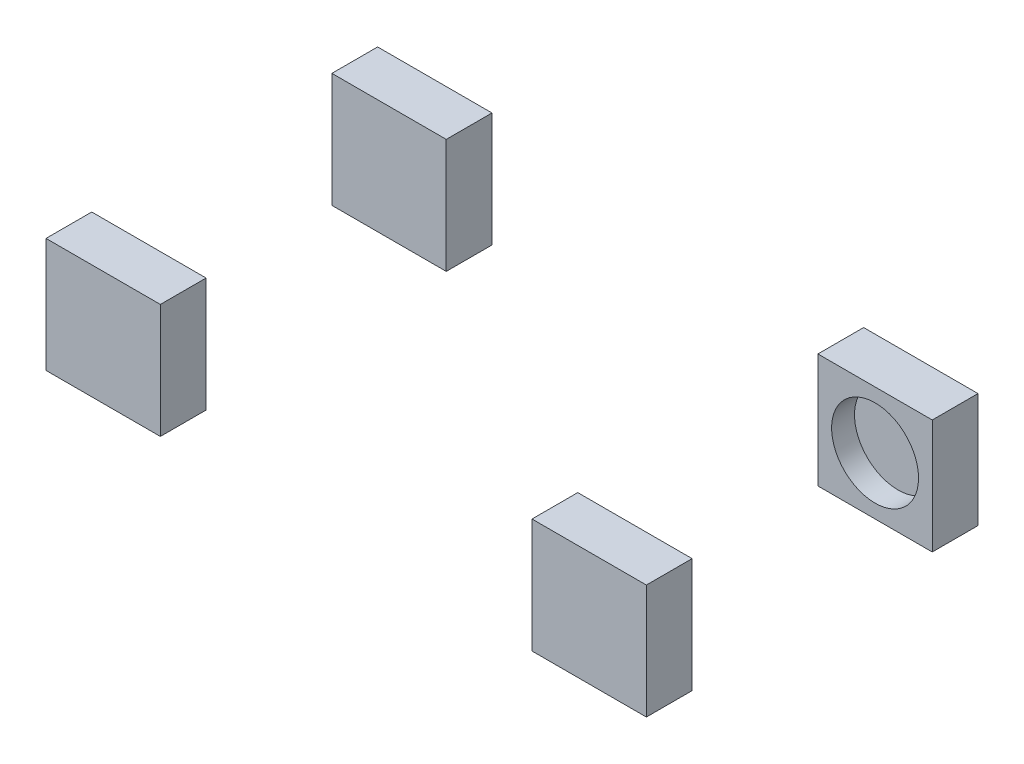
ISO-10303-21;
HEADER;
FILE_DESCRIPTION(('STEP AP214'),'2;1');
FILE_NAME('part.step','',(''),(''),'','','');
FILE_SCHEMA(('AUTOMOTIVE_DESIGN { 1 0 10303 214 1 1 1 1 }'));
ENDSEC;
DATA;
#1=APPLICATION_CONTEXT('core data for automotive mechanical design processes');
#2=APPLICATION_PROTOCOL_DEFINITION('international standard','automotive_design',2000,#1);
#3=PRODUCT_CONTEXT('',#1,'mechanical');
#4=PRODUCT('Part','Part','',(#3));
#5=PRODUCT_RELATED_PRODUCT_CATEGORY('part','',(#4));
#6=PRODUCT_DEFINITION_FORMATION('','',#4);
#7=PRODUCT_DEFINITION_CONTEXT('part definition',#1,'design');
#8=PRODUCT_DEFINITION('design','',#6,#7);
#9=PRODUCT_DEFINITION_SHAPE('','',#8);
#10=(LENGTH_UNIT() NAMED_UNIT(*) SI_UNIT(.MILLI.,.METRE.));
#11=(NAMED_UNIT(*) PLANE_ANGLE_UNIT() SI_UNIT($,.RADIAN.));
#12=(NAMED_UNIT(*) SI_UNIT($,.STERADIAN.) SOLID_ANGLE_UNIT());
#13=UNCERTAINTY_MEASURE_WITH_UNIT(LENGTH_MEASURE(1.E-05),#10,'distance_accuracy_value','');
#14=(GEOMETRIC_REPRESENTATION_CONTEXT(3) GLOBAL_UNCERTAINTY_ASSIGNED_CONTEXT((#13)) GLOBAL_UNIT_ASSIGNED_CONTEXT((#10,
#11,#12)) REPRESENTATION_CONTEXT('',''));
#15=CARTESIAN_POINT('',(0.,0.,0.));
#16=DIRECTION('',(0.,0.,1.));
#17=DIRECTION('',(1.,0.,0.));
#18=AXIS2_PLACEMENT_3D('',#15,#16,#17);
#19=CARTESIAN_POINT('',(0.,50.,105.));
#20=DIRECTION('',(0.,0.,-1.));
#21=DIRECTION('',(-1.,0.,0.));
#22=AXIS2_PLACEMENT_3D('',#19,#20,#21);
#23=PLANE('',#22);
#24=CARTESIAN_POINT('',(212.5,0.,105.));
#25=DIRECTION('',(0.,0.,-1.));
#26=DIRECTION('',(-1.,0.,0.));
#27=AXIS2_PLACEMENT_3D('',#24,#25,#26);
#28=CIRCLE('',#27,38.);
#29=CARTESIAN_POINT('',(174.5,0.,105.));
#30=VERTEX_POINT('',#29);
#31=EDGE_CURVE('E158',#30,#30,#28,.T.);
#32=ORIENTED_EDGE('',*,*,#31,.F.);
#33=EDGE_LOOP('',(#32));
#34=FACE_BOUND('',#33,.T.);
#35=DIRECTION('',(0.,-1.,0.));
#36=VECTOR('',#35,1.);
#37=CARTESIAN_POINT('',(262.5,50.,105.));
#38=LINE('',#37,#36);
#39=CARTESIAN_POINT('',(262.5,50.,105.));
#40=VERTEX_POINT('',#39);
#41=CARTESIAN_POINT('',(262.5,-50.,105.));
#42=VERTEX_POINT('',#41);
#43=EDGE_CURVE('E131',#40,#42,#38,.T.);
#44=ORIENTED_EDGE('',*,*,#43,.T.);
#45=DIRECTION('',(1.,0.,0.));
#46=VECTOR('',#45,1.);
#47=CARTESIAN_POINT('',(162.5,-50.,105.));
#48=LINE('',#47,#46);
#49=CARTESIAN_POINT('',(162.5,-50.,105.));
#50=VERTEX_POINT('',#49);
#51=EDGE_CURVE('E97',#50,#42,#48,.T.);
#52=ORIENTED_EDGE('',*,*,#51,.F.);
#53=DIRECTION('',(0.,-1.,0.));
#54=VECTOR('',#53,1.);
#55=CARTESIAN_POINT('',(162.5,50.,105.));
#56=LINE('',#55,#54);
#57=CARTESIAN_POINT('',(162.5,50.,105.));
#58=VERTEX_POINT('',#57);
#59=EDGE_CURVE('E105',#58,#50,#56,.T.);
#60=ORIENTED_EDGE('',*,*,#59,.F.);
#61=DIRECTION('',(1.,0.,0.));
#62=VECTOR('',#61,1.);
#63=CARTESIAN_POINT('',(162.5,50.,105.));
#64=LINE('',#63,#62);
#65=EDGE_CURVE('E128',#58,#40,#64,.T.);
#66=ORIENTED_EDGE('',*,*,#65,.T.);
#67=EDGE_LOOP('',(#44,#52,#60,#66));
#68=FACE_BOUND('',#67,.T.);
#69=ADVANCED_FACE('F87',(#34,#68),#23,.T.);
#70=CARTESIAN_POINT('',(0.,-50.,0.));
#71=DIRECTION('',(0.,1.,0.));
#72=DIRECTION('',(0.,0.,1.));
#73=AXIS2_PLACEMENT_3D('',#70,#71,#72);
#74=PLANE('',#73);
#75=DIRECTION('',(0.,0.,1.));
#76=VECTOR('',#75,1.);
#77=CARTESIAN_POINT('',(262.5,-50.,0.));
#78=LINE('',#77,#76);
#79=CARTESIAN_POINT('',(262.5,-50.,145.));
#80=VERTEX_POINT('',#79);
#81=EDGE_CURVE('E139',#42,#80,#78,.T.);
#82=ORIENTED_EDGE('',*,*,#81,.T.);
#83=DIRECTION('',(1.,0.,0.));
#84=VECTOR('',#83,1.);
#85=CARTESIAN_POINT('',(0.,-50.,145.));
#86=LINE('',#85,#84);
#87=CARTESIAN_POINT('',(162.5,-50.,145.));
#88=VERTEX_POINT('',#87);
#89=EDGE_CURVE('E146',#88,#80,#86,.T.);
#90=ORIENTED_EDGE('',*,*,#89,.F.);
#91=DIRECTION('',(0.,0.,1.));
#92=VECTOR('',#91,1.);
#93=CARTESIAN_POINT('',(162.5,-50.,105.));
#94=LINE('',#93,#92);
#95=EDGE_CURVE('E13',#50,#88,#94,.T.);
#96=ORIENTED_EDGE('',*,*,#95,.F.);
#97=ORIENTED_EDGE('',*,*,#51,.T.);
#98=EDGE_LOOP('',(#82,#90,#96,#97));
#99=FACE_BOUND('',#98,.T.);
#100=ADVANCED_FACE('F173',(#99),#74,.F.);
#101=CARTESIAN_POINT('',(162.5,50.,-1.12757025938492E-13));
#102=DIRECTION('',(1.,0.,0.));
#103=DIRECTION('',(0.,0.,-1.));
#104=AXIS2_PLACEMENT_3D('',#101,#102,#103);
#105=PLANE('',#104);
#106=ORIENTED_EDGE('',*,*,#95,.T.);
#107=DIRECTION('',(0.,-1.,0.));
#108=VECTOR('',#107,1.);
#109=CARTESIAN_POINT('',(162.5,50.,145.));
#110=LINE('',#109,#108);
#111=CARTESIAN_POINT('',(162.5,50.,145.));
#112=VERTEX_POINT('',#111);
#113=EDGE_CURVE('E140',#112,#88,#110,.T.);
#114=ORIENTED_EDGE('',*,*,#113,.F.);
#115=DIRECTION('',(0.,0.,1.));
#116=VECTOR('',#115,1.);
#117=CARTESIAN_POINT('',(162.5,50.,105.));
#118=LINE('',#117,#116);
#119=EDGE_CURVE('E123',#58,#112,#118,.T.);
#120=ORIENTED_EDGE('',*,*,#119,.F.);
#121=ORIENTED_EDGE('',*,*,#59,.T.);
#122=EDGE_LOOP('',(#106,#114,#120,#121));
#123=FACE_BOUND('',#122,.T.);
#124=ADVANCED_FACE('F175',(#123),#105,.F.);
#125=CARTESIAN_POINT('',(0.,50.,145.));
#126=DIRECTION('',(0.,0.,-1.));
#127=DIRECTION('',(-1.,0.,0.));
#128=AXIS2_PLACEMENT_3D('',#125,#126,#127);
#129=PLANE('',#128);
#130=ORIENTED_EDGE('',*,*,#89,.T.);
#131=DIRECTION('',(0.,-1.,0.));
#132=VECTOR('',#131,1.);
#133=CARTESIAN_POINT('',(262.5,50.,145.));
#134=LINE('',#133,#132);
#135=CARTESIAN_POINT('',(262.5,50.,145.));
#136=VERTEX_POINT('',#135);
#137=EDGE_CURVE('E149',#136,#80,#134,.T.);
#138=ORIENTED_EDGE('',*,*,#137,.F.);
#139=DIRECTION('',(1.,0.,0.));
#140=VECTOR('',#139,1.);
#141=CARTESIAN_POINT('',(0.,50.,145.));
#142=LINE('',#141,#140);
#143=EDGE_CURVE('E144',#112,#136,#142,.T.);
#144=ORIENTED_EDGE('',*,*,#143,.F.);
#145=ORIENTED_EDGE('',*,*,#113,.T.);
#146=EDGE_LOOP('',(#130,#138,#144,#145));
#147=FACE_BOUND('',#146,.T.);
#148=ADVANCED_FACE('F184',(#147),#129,.F.);
#149=CARTESIAN_POINT('',(262.5,50.,0.));
#150=DIRECTION('',(1.,0.,0.));
#151=DIRECTION('',(0.,0.,-1.));
#152=AXIS2_PLACEMENT_3D('',#149,#150,#151);
#153=PLANE('',#152);
#154=ORIENTED_EDGE('',*,*,#81,.F.);
#155=ORIENTED_EDGE('',*,*,#43,.F.);
#156=DIRECTION('',(0.,0.,1.));
#157=VECTOR('',#156,1.);
#158=CARTESIAN_POINT('',(262.5,50.,0.));
#159=LINE('',#158,#157);
#160=EDGE_CURVE('E91',#40,#136,#159,.T.);
#161=ORIENTED_EDGE('',*,*,#160,.T.);
#162=ORIENTED_EDGE('',*,*,#137,.T.);
#163=EDGE_LOOP('',(#154,#155,#161,#162));
#164=FACE_BOUND('',#163,.T.);
#165=ADVANCED_FACE('F137',(#164),#153,.T.);
#166=CARTESIAN_POINT('',(0.,50.,0.));
#167=DIRECTION('',(0.,1.,0.));
#168=DIRECTION('',(0.,0.,1.));
#169=AXIS2_PLACEMENT_3D('',#166,#167,#168);
#170=PLANE('',#169);
#171=ORIENTED_EDGE('',*,*,#160,.F.);
#172=ORIENTED_EDGE('',*,*,#65,.F.);
#173=ORIENTED_EDGE('',*,*,#119,.T.);
#174=ORIENTED_EDGE('',*,*,#143,.T.);
#175=EDGE_LOOP('',(#171,#172,#173,#174));
#176=FACE_BOUND('',#175,.T.);
#177=ADVANCED_FACE('F89',(#176),#170,.T.);
#178=CARTESIAN_POINT('',(212.5,0.,125.));
#179=DIRECTION('',(0.,0.,-1.));
#180=DIRECTION('',(-1.,0.,0.));
#181=AXIS2_PLACEMENT_3D('',#178,#179,#180);
#182=CYLINDRICAL_SURFACE('',#181,38.);
#183=CARTESIAN_POINT('',(212.5,0.,125.));
#184=DIRECTION('',(0.,0.,-1.));
#185=DIRECTION('',(-1.,0.,0.));
#186=AXIS2_PLACEMENT_3D('',#183,#184,#185);
#187=CIRCLE('',#186,38.);
#188=CARTESIAN_POINT('',(174.5,0.,125.));
#189=VERTEX_POINT('',#188);
#190=EDGE_CURVE('E141',#189,#189,#187,.T.);
#191=ORIENTED_EDGE('',*,*,#190,.F.);
#192=EDGE_LOOP('',(#191));
#193=FACE_BOUND('',#192,.T.);
#194=ORIENTED_EDGE('',*,*,#31,.T.);
#195=EDGE_LOOP('',(#194));
#196=FACE_BOUND('',#195,.T.);
#197=ADVANCED_FACE('F166',(#193,#196),#182,.F.);
#198=CARTESIAN_POINT('',(212.5,0.,125.));
#199=DIRECTION('',(0.,0.,-1.));
#200=DIRECTION('',(-1.,0.,0.));
#201=AXIS2_PLACEMENT_3D('',#198,#199,#200);
#202=PLANE('',#201);
#203=ORIENTED_EDGE('',*,*,#190,.T.);
#204=EDGE_LOOP('',(#203));
#205=FACE_BOUND('',#204,.T.);
#206=ADVANCED_FACE('F164',(#205),#202,.T.);
#207=CLOSED_SHELL('',(#69,#100,#124,#148,#165,#177,#197,#206));
#208=MANIFOLD_SOLID_BREP('B2',#207);
#209=CARTESIAN_POINT('',(-162.5,50.,-1.12757025938492E-13));
#210=DIRECTION('',(1.,0.,0.));
#211=DIRECTION('',(0.,0.,-1.));
#212=AXIS2_PLACEMENT_3D('',#209,#210,#211);
#213=PLANE('',#212);
#214=DIRECTION('',(0.,0.,1.));
#215=VECTOR('',#214,1.);
#216=CARTESIAN_POINT('',(-162.5,-50.,-1.12757025938492E-13));
#217=LINE('',#216,#215);
#218=CARTESIAN_POINT('',(-162.5,-50.,105.));
#219=VERTEX_POINT('',#218);
#220=CARTESIAN_POINT('',(-162.5,-50.,145.));
#221=VERTEX_POINT('',#220);
#222=EDGE_CURVE('E85',#219,#221,#217,.T.);
#223=ORIENTED_EDGE('',*,*,#222,.F.);
#224=DIRECTION('',(0.,-1.,0.));
#225=VECTOR('',#224,1.);
#226=CARTESIAN_POINT('',(-162.5,50.,105.));
#227=LINE('',#226,#225);
#228=CARTESIAN_POINT('',(-162.5,50.,105.));
#229=VERTEX_POINT('',#228);
#230=EDGE_CURVE('E281',#229,#219,#227,.T.);
#231=ORIENTED_EDGE('',*,*,#230,.F.);
#232=DIRECTION('',(0.,0.,1.));
#233=VECTOR('',#232,1.);
#234=CARTESIAN_POINT('',(-162.5,50.,-1.12757025938492E-13));
#235=LINE('',#234,#233);
#236=CARTESIAN_POINT('',(-162.5,50.,145.));
#237=VERTEX_POINT('',#236);
#238=EDGE_CURVE('E266',#229,#237,#235,.T.);
#239=ORIENTED_EDGE('',*,*,#238,.T.);
#240=DIRECTION('',(0.,-1.,0.));
#241=VECTOR('',#240,1.);
#242=CARTESIAN_POINT('',(-162.5,50.,145.));
#243=LINE('',#242,#241);
#244=EDGE_CURVE('E304',#237,#221,#243,.T.);
#245=ORIENTED_EDGE('',*,*,#244,.T.);
#246=EDGE_LOOP('',(#223,#231,#239,#245));
#247=FACE_BOUND('',#246,.T.);
#248=ADVANCED_FACE('F262',(#247),#213,.T.);
#249=CARTESIAN_POINT('',(0.,50.,105.));
#250=DIRECTION('',(0.,0.,1.));
#251=DIRECTION('',(1.,0.,0.));
#252=AXIS2_PLACEMENT_3D('',#249,#250,#251);
#253=PLANE('',#252);
#254=DIRECTION('',(-1.,0.,0.));
#255=VECTOR('',#254,1.);
#256=CARTESIAN_POINT('',(0.,-50.,105.));
#257=LINE('',#256,#255);
#258=CARTESIAN_POINT('',(-262.5,-50.,105.));
#259=VERTEX_POINT('',#258);
#260=EDGE_CURVE('E272',#219,#259,#257,.T.);
#261=ORIENTED_EDGE('',*,*,#260,.T.);
#262=DIRECTION('',(0.,-1.,0.));
#263=VECTOR('',#262,1.);
#264=CARTESIAN_POINT('',(-262.5,50.,105.));
#265=LINE('',#264,#263);
#266=CARTESIAN_POINT('',(-262.5,50.,105.));
#267=VERTEX_POINT('',#266);
#268=EDGE_CURVE('E319',#267,#259,#265,.T.);
#269=ORIENTED_EDGE('',*,*,#268,.F.);
#270=DIRECTION('',(-1.,0.,0.));
#271=VECTOR('',#270,1.);
#272=CARTESIAN_POINT('',(0.,50.,105.));
#273=LINE('',#272,#271);
#274=EDGE_CURVE('E296',#229,#267,#273,.T.);
#275=ORIENTED_EDGE('',*,*,#274,.F.);
#276=ORIENTED_EDGE('',*,*,#230,.T.);
#277=EDGE_LOOP('',(#261,#269,#275,#276));
#278=FACE_BOUND('',#277,.T.);
#279=ADVANCED_FACE('F335',(#278),#253,.F.);
#280=CARTESIAN_POINT('',(-262.5,50.,0.));
#281=DIRECTION('',(1.,0.,0.));
#282=DIRECTION('',(0.,0.,-1.));
#283=AXIS2_PLACEMENT_3D('',#280,#281,#282);
#284=PLANE('',#283);
#285=DIRECTION('',(0.,0.,1.));
#286=VECTOR('',#285,1.);
#287=CARTESIAN_POINT('',(-262.5,-50.,0.));
#288=LINE('',#287,#286);
#289=CARTESIAN_POINT('',(-262.5,-50.,145.));
#290=VERTEX_POINT('',#289);
#291=EDGE_CURVE('E323',#259,#290,#288,.T.);
#292=ORIENTED_EDGE('',*,*,#291,.T.);
#293=DIRECTION('',(0.,-1.,0.));
#294=VECTOR('',#293,1.);
#295=CARTESIAN_POINT('',(-262.5,50.,145.));
#296=LINE('',#295,#294);
#297=CARTESIAN_POINT('',(-262.5,50.,145.));
#298=VERTEX_POINT('',#297);
#299=EDGE_CURVE('E310',#298,#290,#296,.T.);
#300=ORIENTED_EDGE('',*,*,#299,.F.);
#301=DIRECTION('',(0.,0.,1.));
#302=VECTOR('',#301,1.);
#303=CARTESIAN_POINT('',(-262.5,50.,0.));
#304=LINE('',#303,#302);
#305=EDGE_CURVE('E333',#267,#298,#304,.T.);
#306=ORIENTED_EDGE('',*,*,#305,.F.);
#307=ORIENTED_EDGE('',*,*,#268,.T.);
#308=EDGE_LOOP('',(#292,#300,#306,#307));
#309=FACE_BOUND('',#308,.T.);
#310=ADVANCED_FACE('F324',(#309),#284,.F.);
#311=CARTESIAN_POINT('',(0.,50.,145.));
#312=DIRECTION('',(0.,0.,1.));
#313=DIRECTION('',(1.,0.,0.));
#314=AXIS2_PLACEMENT_3D('',#311,#312,#313);
#315=PLANE('',#314);
#316=DIRECTION('',(-1.,0.,0.));
#317=VECTOR('',#316,1.);
#318=CARTESIAN_POINT('',(0.,-50.,145.));
#319=LINE('',#318,#317);
#320=EDGE_CURVE('E314',#221,#290,#319,.T.);
#321=ORIENTED_EDGE('',*,*,#320,.F.);
#322=ORIENTED_EDGE('',*,*,#244,.F.);
#323=DIRECTION('',(-1.,0.,0.));
#324=VECTOR('',#323,1.);
#325=CARTESIAN_POINT('',(0.,50.,145.));
#326=LINE('',#325,#324);
#327=EDGE_CURVE('E316',#237,#298,#326,.T.);
#328=ORIENTED_EDGE('',*,*,#327,.T.);
#329=ORIENTED_EDGE('',*,*,#299,.T.);
#330=EDGE_LOOP('',(#321,#322,#328,#329));
#331=FACE_BOUND('',#330,.T.);
#332=ADVANCED_FACE('F312',(#331),#315,.T.);
#333=CARTESIAN_POINT('',(0.,50.,0.));
#334=DIRECTION('',(0.,1.,0.));
#335=DIRECTION('',(0.,0.,1.));
#336=AXIS2_PLACEMENT_3D('',#333,#334,#335);
#337=PLANE('',#336);
#338=ORIENTED_EDGE('',*,*,#238,.F.);
#339=ORIENTED_EDGE('',*,*,#274,.T.);
#340=ORIENTED_EDGE('',*,*,#305,.T.);
#341=ORIENTED_EDGE('',*,*,#327,.F.);
#342=EDGE_LOOP('',(#338,#339,#340,#341));
#343=FACE_BOUND('',#342,.T.);
#344=ADVANCED_FACE('F264',(#343),#337,.T.);
#345=CARTESIAN_POINT('',(0.,-50.,0.));
#346=DIRECTION('',(0.,1.,0.));
#347=DIRECTION('',(0.,0.,1.));
#348=AXIS2_PLACEMENT_3D('',#345,#346,#347);
#349=PLANE('',#348);
#350=ORIENTED_EDGE('',*,*,#222,.T.);
#351=ORIENTED_EDGE('',*,*,#320,.T.);
#352=ORIENTED_EDGE('',*,*,#291,.F.);
#353=ORIENTED_EDGE('',*,*,#260,.F.);
#354=EDGE_LOOP('',(#350,#351,#352,#353));
#355=FACE_BOUND('',#354,.T.);
#356=ADVANCED_FACE('F327',(#355),#349,.F.);
#357=CLOSED_SHELL('',(#248,#279,#310,#332,#344,#356));
#358=MANIFOLD_SOLID_BREP('B7',#357);
#359=CARTESIAN_POINT('',(0.,50.,-105.));
#360=DIRECTION('',(0.,0.,-1.));
#361=DIRECTION('',(-1.,0.,0.));
#362=AXIS2_PLACEMENT_3D('',#359,#360,#361);
#363=PLANE('',#362);
#364=CARTESIAN_POINT('',(212.5,0.,-105.));
#365=DIRECTION('',(0.,0.,1.));
#366=DIRECTION('',(1.,0.,0.));
#367=AXIS2_PLACEMENT_3D('',#364,#365,#366);
#368=CIRCLE('',#367,38.);
#369=CARTESIAN_POINT('',(250.5,0.,-105.));
#370=VERTEX_POINT('',#369);
#371=EDGE_CURVE('E476',#370,#370,#368,.T.);
#372=ORIENTED_EDGE('',*,*,#371,.F.);
#373=EDGE_LOOP('',(#372));
#374=FACE_BOUND('',#373,.T.);
#375=DIRECTION('',(1.,0.,0.));
#376=VECTOR('',#375,1.);
#377=CARTESIAN_POINT('',(0.,-50.,-105.));
#378=LINE('',#377,#376);
#379=CARTESIAN_POINT('',(162.5,-50.,-105.));
#380=VERTEX_POINT('',#379);
#381=CARTESIAN_POINT('',(262.5,-50.,-105.));
#382=VERTEX_POINT('',#381);
#383=EDGE_CURVE('E260',#380,#382,#378,.T.);
#384=ORIENTED_EDGE('',*,*,#383,.T.);
#385=DIRECTION('',(0.,-1.,0.));
#386=VECTOR('',#385,1.);
#387=CARTESIAN_POINT('',(262.5,50.,-105.));
#388=LINE('',#387,#386);
#389=CARTESIAN_POINT('',(262.5,50.,-105.));
#390=VERTEX_POINT('',#389);
#391=EDGE_CURVE('E471',#390,#382,#388,.T.);
#392=ORIENTED_EDGE('',*,*,#391,.F.);
#393=DIRECTION('',(1.,0.,0.));
#394=VECTOR('',#393,1.);
#395=CARTESIAN_POINT('',(0.,50.,-105.));
#396=LINE('',#395,#394);
#397=CARTESIAN_POINT('',(162.5,50.,-105.));
#398=VERTEX_POINT('',#397);
#399=EDGE_CURVE('E404',#398,#390,#396,.T.);
#400=ORIENTED_EDGE('',*,*,#399,.F.);
#401=DIRECTION('',(0.,-1.,0.));
#402=VECTOR('',#401,1.);
#403=CARTESIAN_POINT('',(162.5,50.,-105.));
#404=LINE('',#403,#402);
#405=EDGE_CURVE('E444',#398,#380,#404,.T.);
#406=ORIENTED_EDGE('',*,*,#405,.T.);
#407=EDGE_LOOP('',(#384,#392,#400,#406));
#408=FACE_BOUND('',#407,.T.);
#409=ADVANCED_FACE('F400',(#374,#408),#363,.F.);
#410=CARTESIAN_POINT('',(262.5,50.,0.));
#411=DIRECTION('',(-1.,0.,0.));
#412=DIRECTION('',(0.,0.,1.));
#413=AXIS2_PLACEMENT_3D('',#410,#411,#412);
#414=PLANE('',#413);
#415=DIRECTION('',(0.,0.,-1.));
#416=VECTOR('',#415,1.);
#417=CARTESIAN_POINT('',(262.5,-50.,0.));
#418=LINE('',#417,#416);
#419=CARTESIAN_POINT('',(262.5,-50.,-145.));
#420=VERTEX_POINT('',#419);
#421=EDGE_CURVE('E410',#382,#420,#418,.T.);
#422=ORIENTED_EDGE('',*,*,#421,.T.);
#423=DIRECTION('',(0.,-1.,0.));
#424=VECTOR('',#423,1.);
#425=CARTESIAN_POINT('',(262.5,50.,-145.));
#426=LINE('',#425,#424);
#427=CARTESIAN_POINT('',(262.5,50.,-145.));
#428=VERTEX_POINT('',#427);
#429=EDGE_CURVE('E458',#428,#420,#426,.T.);
#430=ORIENTED_EDGE('',*,*,#429,.F.);
#431=DIRECTION('',(0.,0.,-1.));
#432=VECTOR('',#431,1.);
#433=CARTESIAN_POINT('',(262.5,50.,0.));
#434=LINE('',#433,#432);
#435=EDGE_CURVE('E436',#390,#428,#434,.T.);
#436=ORIENTED_EDGE('',*,*,#435,.F.);
#437=ORIENTED_EDGE('',*,*,#391,.T.);
#438=EDGE_LOOP('',(#422,#430,#436,#437));
#439=FACE_BOUND('',#438,.T.);
#440=ADVANCED_FACE('F485',(#439),#414,.F.);
#441=CARTESIAN_POINT('',(0.,50.,-145.));
#442=DIRECTION('',(0.,0.,-1.));
#443=DIRECTION('',(-1.,0.,0.));
#444=AXIS2_PLACEMENT_3D('',#441,#442,#443);
#445=PLANE('',#444);
#446=DIRECTION('',(1.,0.,0.));
#447=VECTOR('',#446,1.);
#448=CARTESIAN_POINT('',(0.,-50.,-145.));
#449=LINE('',#448,#447);
#450=CARTESIAN_POINT('',(162.5,-50.,-145.));
#451=VERTEX_POINT('',#450);
#452=EDGE_CURVE('E460',#451,#420,#449,.T.);
#453=ORIENTED_EDGE('',*,*,#452,.F.);
#454=DIRECTION('',(0.,-1.,0.));
#455=VECTOR('',#454,1.);
#456=CARTESIAN_POINT('',(162.5,50.,-145.));
#457=LINE('',#456,#455);
#458=CARTESIAN_POINT('',(162.5,50.,-145.));
#459=VERTEX_POINT('',#458);
#460=EDGE_CURVE('E449',#459,#451,#457,.T.);
#461=ORIENTED_EDGE('',*,*,#460,.F.);
#462=DIRECTION('',(1.,0.,0.));
#463=VECTOR('',#462,1.);
#464=CARTESIAN_POINT('',(0.,50.,-145.));
#465=LINE('',#464,#463);
#466=EDGE_CURVE('E469',#459,#428,#465,.T.);
#467=ORIENTED_EDGE('',*,*,#466,.T.);
#468=ORIENTED_EDGE('',*,*,#429,.T.);
#469=EDGE_LOOP('',(#453,#461,#467,#468));
#470=FACE_BOUND('',#469,.T.);
#471=ADVANCED_FACE('F461',(#470),#445,.T.);
#472=CARTESIAN_POINT('',(162.5,50.,0.));
#473=DIRECTION('',(-1.,0.,0.));
#474=DIRECTION('',(0.,0.,1.));
#475=AXIS2_PLACEMENT_3D('',#472,#473,#474);
#476=PLANE('',#475);
#477=DIRECTION('',(0.,0.,-1.));
#478=VECTOR('',#477,1.);
#479=CARTESIAN_POINT('',(162.5,-50.,0.));
#480=LINE('',#479,#478);
#481=EDGE_CURVE('E453',#380,#451,#480,.T.);
#482=ORIENTED_EDGE('',*,*,#481,.F.);
#483=ORIENTED_EDGE('',*,*,#405,.F.);
#484=DIRECTION('',(0.,0.,-1.));
#485=VECTOR('',#484,1.);
#486=CARTESIAN_POINT('',(162.5,50.,0.));
#487=LINE('',#486,#485);
#488=EDGE_CURVE('E455',#398,#459,#487,.T.);
#489=ORIENTED_EDGE('',*,*,#488,.T.);
#490=ORIENTED_EDGE('',*,*,#460,.T.);
#491=EDGE_LOOP('',(#482,#483,#489,#490));
#492=FACE_BOUND('',#491,.T.);
#493=ADVANCED_FACE('F451',(#492),#476,.T.);
#494=CARTESIAN_POINT('',(0.,50.,0.));
#495=DIRECTION('',(0.,1.,0.));
#496=DIRECTION('',(0.,0.,1.));
#497=AXIS2_PLACEMENT_3D('',#494,#495,#496);
#498=PLANE('',#497);
#499=ORIENTED_EDGE('',*,*,#399,.T.);
#500=ORIENTED_EDGE('',*,*,#435,.T.);
#501=ORIENTED_EDGE('',*,*,#466,.F.);
#502=ORIENTED_EDGE('',*,*,#488,.F.);
#503=EDGE_LOOP('',(#499,#500,#501,#502));
#504=FACE_BOUND('',#503,.T.);
#505=ADVANCED_FACE('F402',(#504),#498,.T.);
#506=CARTESIAN_POINT('',(0.,-50.,0.));
#507=DIRECTION('',(0.,1.,0.));
#508=DIRECTION('',(0.,0.,1.));
#509=AXIS2_PLACEMENT_3D('',#506,#507,#508);
#510=PLANE('',#509);
#511=ORIENTED_EDGE('',*,*,#383,.F.);
#512=ORIENTED_EDGE('',*,*,#481,.T.);
#513=ORIENTED_EDGE('',*,*,#452,.T.);
#514=ORIENTED_EDGE('',*,*,#421,.F.);
#515=EDGE_LOOP('',(#511,#512,#513,#514));
#516=FACE_BOUND('',#515,.T.);
#517=ADVANCED_FACE('F463',(#516),#510,.F.);
#518=CARTESIAN_POINT('',(212.5,0.,-125.));
#519=DIRECTION('',(0.,0.,1.));
#520=DIRECTION('',(1.,0.,0.));
#521=AXIS2_PLACEMENT_3D('',#518,#519,#520);
#522=CYLINDRICAL_SURFACE('',#521,38.);
#523=CARTESIAN_POINT('',(212.5,0.,-125.));
#524=DIRECTION('',(0.,0.,1.));
#525=DIRECTION('',(1.,0.,0.));
#526=AXIS2_PLACEMENT_3D('',#523,#524,#525);
#527=CIRCLE('',#526,38.);
#528=CARTESIAN_POINT('',(250.5,0.,-125.));
#529=VERTEX_POINT('',#528);
#530=EDGE_CURVE('E472',#529,#529,#527,.T.);
#531=ORIENTED_EDGE('',*,*,#530,.F.);
#532=EDGE_LOOP('',(#531));
#533=FACE_BOUND('',#532,.T.);
#534=ORIENTED_EDGE('',*,*,#371,.T.);
#535=EDGE_LOOP('',(#534));
#536=FACE_BOUND('',#535,.T.);
#537=ADVANCED_FACE('F482',(#533,#536),#522,.F.);
#538=CARTESIAN_POINT('',(212.5,0.,-125.));
#539=DIRECTION('',(0.,0.,1.));
#540=DIRECTION('',(1.,0.,0.));
#541=AXIS2_PLACEMENT_3D('',#538,#539,#540);
#542=PLANE('',#541);
#543=ORIENTED_EDGE('',*,*,#530,.T.);
#544=EDGE_LOOP('',(#543));
#545=FACE_BOUND('',#544,.T.);
#546=ADVANCED_FACE('F502',(#545),#542,.T.);
#547=CLOSED_SHELL('',(#409,#440,#471,#493,#505,#517,#537,#546));
#548=MANIFOLD_SOLID_BREP('B79',#547);
#549=CARTESIAN_POINT('',(0.,50.,-105.));
#550=DIRECTION('',(0.,0.,1.));
#551=DIRECTION('',(1.,0.,0.));
#552=AXIS2_PLACEMENT_3D('',#549,#550,#551);
#553=PLANE('',#552);
#554=DIRECTION('',(-1.,0.,0.));
#555=VECTOR('',#554,1.);
#556=CARTESIAN_POINT('',(0.,-50.,-105.));
#557=LINE('',#556,#555);
#558=CARTESIAN_POINT('',(-162.5,-50.,-105.));
#559=VERTEX_POINT('',#558);
#560=CARTESIAN_POINT('',(-262.5,-50.,-105.));
#561=VERTEX_POINT('',#560);
#562=EDGE_CURVE('E622',#559,#561,#557,.T.);
#563=ORIENTED_EDGE('',*,*,#562,.F.);
#564=DIRECTION('',(0.,-1.,0.));
#565=VECTOR('',#564,1.);
#566=CARTESIAN_POINT('',(-162.5,50.,-105.));
#567=LINE('',#566,#565);
#568=CARTESIAN_POINT('',(-162.5,50.,-105.));
#569=VERTEX_POINT('',#568);
#570=EDGE_CURVE('E398',#569,#559,#567,.T.);
#571=ORIENTED_EDGE('',*,*,#570,.F.);
#572=DIRECTION('',(-1.,0.,0.));
#573=VECTOR('',#572,1.);
#574=CARTESIAN_POINT('',(0.,50.,-105.));
#575=LINE('',#574,#573);
#576=CARTESIAN_POINT('',(-262.5,50.,-105.));
#577=VERTEX_POINT('',#576);
#578=EDGE_CURVE('E607',#569,#577,#575,.T.);
#579=ORIENTED_EDGE('',*,*,#578,.T.);
#580=DIRECTION('',(0.,-1.,0.));
#581=VECTOR('',#580,1.);
#582=CARTESIAN_POINT('',(-262.5,50.,-105.));
#583=LINE('',#582,#581);
#584=EDGE_CURVE('E575',#577,#561,#583,.T.);
#585=ORIENTED_EDGE('',*,*,#584,.T.);
#586=EDGE_LOOP('',(#563,#571,#579,#585));
#587=FACE_BOUND('',#586,.T.);
#588=ADVANCED_FACE('F559',(#587),#553,.T.);
#589=CARTESIAN_POINT('',(-162.5,50.,0.));
#590=DIRECTION('',(-1.,0.,0.));
#591=DIRECTION('',(0.,0.,1.));
#592=AXIS2_PLACEMENT_3D('',#589,#590,#591);
#593=PLANE('',#592);
#594=DIRECTION('',(0.,0.,-1.));
#595=VECTOR('',#594,1.);
#596=CARTESIAN_POINT('',(-162.5,-50.,0.));
#597=LINE('',#596,#595);
#598=CARTESIAN_POINT('',(-162.5,-50.,-145.));
#599=VERTEX_POINT('',#598);
#600=EDGE_CURVE('E613',#559,#599,#597,.T.);
#601=ORIENTED_EDGE('',*,*,#600,.T.);
#602=DIRECTION('',(0.,-1.,0.));
#603=VECTOR('',#602,1.);
#604=CARTESIAN_POINT('',(-162.5,50.,-145.));
#605=LINE('',#604,#603);
#606=CARTESIAN_POINT('',(-162.5,50.,-145.));
#607=VERTEX_POINT('',#606);
#608=EDGE_CURVE('E567',#607,#599,#605,.T.);
#609=ORIENTED_EDGE('',*,*,#608,.F.);
#610=DIRECTION('',(0.,0.,-1.));
#611=VECTOR('',#610,1.);
#612=CARTESIAN_POINT('',(-162.5,50.,0.));
#613=LINE('',#612,#611);
#614=EDGE_CURVE('E601',#569,#607,#613,.T.);
#615=ORIENTED_EDGE('',*,*,#614,.F.);
#616=ORIENTED_EDGE('',*,*,#570,.T.);
#617=EDGE_LOOP('',(#601,#609,#615,#616));
#618=FACE_BOUND('',#617,.T.);
#619=ADVANCED_FACE('F611',(#618),#593,.F.);
#620=CARTESIAN_POINT('',(0.,50.,-145.));
#621=DIRECTION('',(0.,0.,1.));
#622=DIRECTION('',(1.,0.,0.));
#623=AXIS2_PLACEMENT_3D('',#620,#621,#622);
#624=PLANE('',#623);
#625=DIRECTION('',(-1.,0.,0.));
#626=VECTOR('',#625,1.);
#627=CARTESIAN_POINT('',(0.,-50.,-145.));
#628=LINE('',#627,#626);
#629=CARTESIAN_POINT('',(-262.5,-50.,-145.));
#630=VERTEX_POINT('',#629);
#631=EDGE_CURVE('E625',#599,#630,#628,.T.);
#632=ORIENTED_EDGE('',*,*,#631,.T.);
#633=DIRECTION('',(0.,-1.,0.));
#634=VECTOR('',#633,1.);
#635=CARTESIAN_POINT('',(-262.5,50.,-145.));
#636=LINE('',#635,#634);
#637=CARTESIAN_POINT('',(-262.5,50.,-145.));
#638=VERTEX_POINT('',#637);
#639=EDGE_CURVE('E589',#638,#630,#636,.T.);
#640=ORIENTED_EDGE('',*,*,#639,.F.);
#641=DIRECTION('',(-1.,0.,0.));
#642=VECTOR('',#641,1.);
#643=CARTESIAN_POINT('',(0.,50.,-145.));
#644=LINE('',#643,#642);
#645=EDGE_CURVE('E606',#607,#638,#644,.T.);
#646=ORIENTED_EDGE('',*,*,#645,.F.);
#647=ORIENTED_EDGE('',*,*,#608,.T.);
#648=EDGE_LOOP('',(#632,#640,#646,#647));
#649=FACE_BOUND('',#648,.T.);
#650=ADVANCED_FACE('F616',(#649),#624,.F.);
#651=CARTESIAN_POINT('',(-262.5,50.,0.));
#652=DIRECTION('',(-1.,0.,0.));
#653=DIRECTION('',(0.,0.,1.));
#654=AXIS2_PLACEMENT_3D('',#651,#652,#653);
#655=PLANE('',#654);
#656=DIRECTION('',(0.,0.,-1.));
#657=VECTOR('',#656,1.);
#658=CARTESIAN_POINT('',(-262.5,-50.,0.));
#659=LINE('',#658,#657);
#660=EDGE_CURVE('E627',#561,#630,#659,.T.);
#661=ORIENTED_EDGE('',*,*,#660,.F.);
#662=ORIENTED_EDGE('',*,*,#584,.F.);
#663=DIRECTION('',(0.,0.,-1.));
#664=VECTOR('',#663,1.);
#665=CARTESIAN_POINT('',(-262.5,50.,0.));
#666=LINE('',#665,#664);
#667=EDGE_CURVE('E617',#577,#638,#666,.T.);
#668=ORIENTED_EDGE('',*,*,#667,.T.);
#669=ORIENTED_EDGE('',*,*,#639,.T.);
#670=EDGE_LOOP('',(#661,#662,#668,#669));
#671=FACE_BOUND('',#670,.T.);
#672=ADVANCED_FACE('F632',(#671),#655,.T.);
#673=CARTESIAN_POINT('',(0.,50.,0.));
#674=DIRECTION('',(0.,1.,0.));
#675=DIRECTION('',(0.,0.,1.));
#676=AXIS2_PLACEMENT_3D('',#673,#674,#675);
#677=PLANE('',#676);
#678=ORIENTED_EDGE('',*,*,#578,.F.);
#679=ORIENTED_EDGE('',*,*,#614,.T.);
#680=ORIENTED_EDGE('',*,*,#645,.T.);
#681=ORIENTED_EDGE('',*,*,#667,.F.);
#682=EDGE_LOOP('',(#678,#679,#680,#681));
#683=FACE_BOUND('',#682,.T.);
#684=ADVANCED_FACE('F603',(#683),#677,.T.);
#685=CARTESIAN_POINT('',(0.,-50.,0.));
#686=DIRECTION('',(0.,1.,0.));
#687=DIRECTION('',(0.,0.,1.));
#688=AXIS2_PLACEMENT_3D('',#685,#686,#687);
#689=PLANE('',#688);
#690=ORIENTED_EDGE('',*,*,#562,.T.);
#691=ORIENTED_EDGE('',*,*,#660,.T.);
#692=ORIENTED_EDGE('',*,*,#631,.F.);
#693=ORIENTED_EDGE('',*,*,#600,.F.);
#694=EDGE_LOOP('',(#690,#691,#692,#693));
#695=FACE_BOUND('',#694,.T.);
#696=ADVANCED_FACE('F639',(#695),#689,.F.);
#697=CLOSED_SHELL('',(#588,#619,#650,#672,#684,#696));
#698=MANIFOLD_SOLID_BREP('B254',#697);
#699=ADVANCED_BREP_SHAPE_REPRESENTATION('',(#18,#208,#358,#548,#698),#14);
#700=SHAPE_DEFINITION_REPRESENTATION(#9,#699);
ENDSEC;
END-ISO-10303-21;
